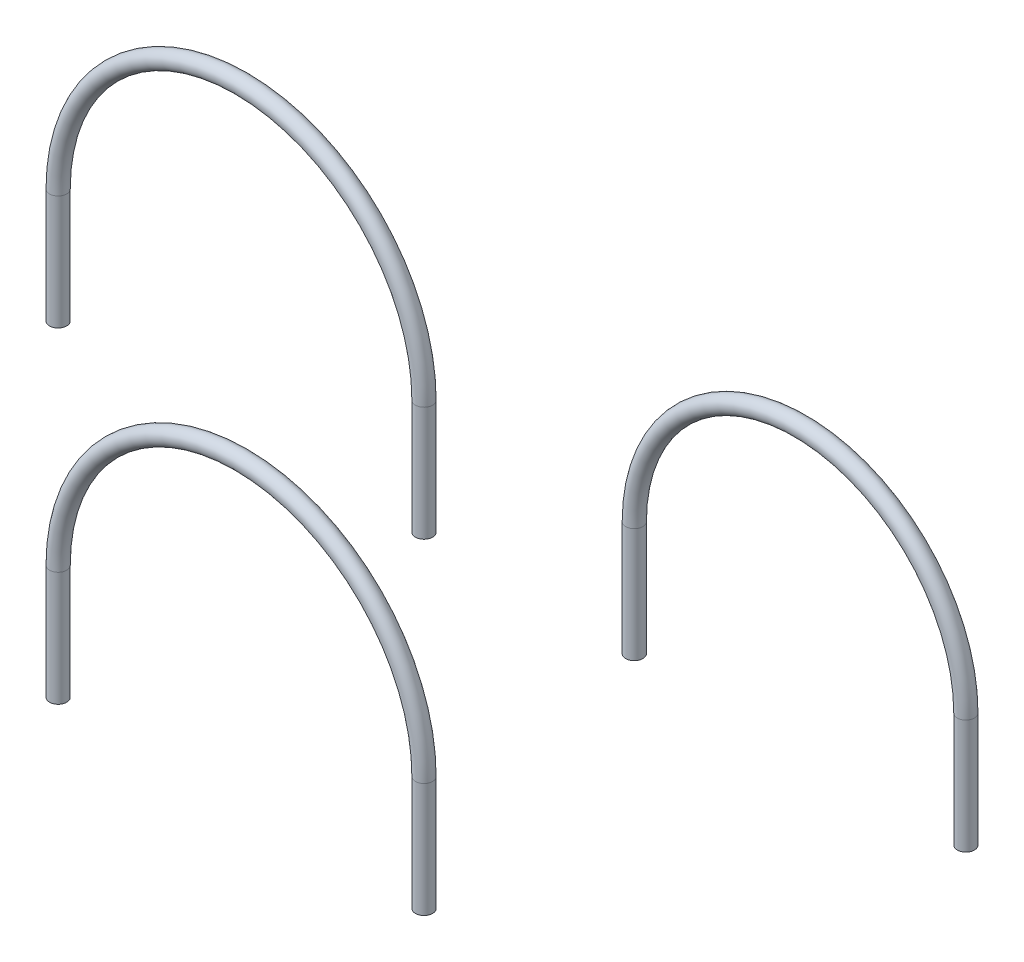
ISO-10303-21;
HEADER;
FILE_DESCRIPTION(('STEP AP214'),'2;1');
FILE_NAME('part.step','',(''),(''),'','','');
FILE_SCHEMA(('AUTOMOTIVE_DESIGN { 1 0 10303 214 1 1 1 1 }'));
ENDSEC;
DATA;
#1=APPLICATION_CONTEXT('core data for automotive mechanical design processes');
#2=APPLICATION_PROTOCOL_DEFINITION('international standard','automotive_design',2000,#1);
#3=PRODUCT_CONTEXT('',#1,'mechanical');
#4=PRODUCT('Part','Part','',(#3));
#5=PRODUCT_RELATED_PRODUCT_CATEGORY('part','',(#4));
#6=PRODUCT_DEFINITION_FORMATION('','',#4);
#7=PRODUCT_DEFINITION_CONTEXT('part definition',#1,'design');
#8=PRODUCT_DEFINITION('design','',#6,#7);
#9=PRODUCT_DEFINITION_SHAPE('','',#8);
#10=(LENGTH_UNIT() NAMED_UNIT(*) SI_UNIT(.MILLI.,.METRE.));
#11=(NAMED_UNIT(*) PLANE_ANGLE_UNIT() SI_UNIT($,.RADIAN.));
#12=(NAMED_UNIT(*) SI_UNIT($,.STERADIAN.) SOLID_ANGLE_UNIT());
#13=UNCERTAINTY_MEASURE_WITH_UNIT(LENGTH_MEASURE(1.E-05),#10,'distance_accuracy_value','');
#14=(GEOMETRIC_REPRESENTATION_CONTEXT(3) GLOBAL_UNCERTAINTY_ASSIGNED_CONTEXT((#13)) GLOBAL_UNIT_ASSIGNED_CONTEXT((#10,
#11,#12)) REPRESENTATION_CONTEXT('',''));
#15=CARTESIAN_POINT('',(0.,0.,0.));
#16=DIRECTION('',(0.,0.,1.));
#17=DIRECTION('',(1.,0.,0.));
#18=AXIS2_PLACEMENT_3D('',#15,#16,#17);
#19=CARTESIAN_POINT('',(703.331586522493,-1540.,0.));
#20=DIRECTION('',(0.,1.,0.));
#21=DIRECTION('',(-1.,0.,0.));
#22=AXIS2_PLACEMENT_3D('',#19,#20,#21);
#23=PLANE('',#22);
#24=CARTESIAN_POINT('',(703.331586522493,-1540.,0.));
#25=DIRECTION('',(0.,1.,0.));
#26=DIRECTION('',(-1.,0.,0.));
#27=AXIS2_PLACEMENT_3D('',#24,#25,#26);
#28=CIRCLE('',#27,27.);
#29=CARTESIAN_POINT('',(676.331586522493,-1540.,0.));
#30=VERTEX_POINT('',#29);
#31=EDGE_CURVE('E97',#30,#30,#28,.T.);
#32=ORIENTED_EDGE('',*,*,#31,.T.);
#33=EDGE_LOOP('',(#32));
#34=FACE_BOUND('',#33,.T.);
#35=CARTESIAN_POINT('',(703.331586522493,-1540.,0.));
#36=DIRECTION('',(0.,1.,0.));
#37=DIRECTION('',(-1.,0.,0.));
#38=AXIS2_PLACEMENT_3D('',#35,#36,#37);
#39=CIRCLE('',#38,30.);
#40=CARTESIAN_POINT('',(673.331586522493,-1540.,0.));
#41=VERTEX_POINT('',#40);
#42=EDGE_CURVE('E88',#41,#41,#39,.T.);
#43=ORIENTED_EDGE('',*,*,#42,.F.);
#44=EDGE_LOOP('',(#43));
#45=FACE_BOUND('',#44,.T.);
#46=ADVANCED_FACE('F74',(#34,#45),#23,.F.);
#47=CARTESIAN_POINT('',(-576.668413477507,-1540.,0.));
#48=DIRECTION('',(0.,-1.,0.));
#49=DIRECTION('',(1.,0.,0.));
#50=AXIS2_PLACEMENT_3D('',#47,#48,#49);
#51=PLANE('',#50);
#52=CARTESIAN_POINT('',(-576.668413477507,-1540.,0.));
#53=DIRECTION('',(0.,-1.,0.));
#54=DIRECTION('',(1.,0.,0.));
#55=AXIS2_PLACEMENT_3D('',#52,#53,#54);
#56=CIRCLE('',#55,27.);
#57=CARTESIAN_POINT('',(-549.668413477507,-1540.,0.));
#58=VERTEX_POINT('',#57);
#59=EDGE_CURVE('E93',#58,#58,#56,.T.);
#60=ORIENTED_EDGE('',*,*,#59,.F.);
#61=EDGE_LOOP('',(#60));
#62=FACE_BOUND('',#61,.T.);
#63=CARTESIAN_POINT('',(-576.668413477507,-1540.,0.));
#64=DIRECTION('',(0.,-1.,0.));
#65=DIRECTION('',(1.,0.,0.));
#66=AXIS2_PLACEMENT_3D('',#63,#64,#65);
#67=CIRCLE('',#66,30.);
#68=CARTESIAN_POINT('',(-546.668413477507,-1540.,0.));
#69=VERTEX_POINT('',#68);
#70=EDGE_CURVE('E12',#69,#69,#67,.T.);
#71=ORIENTED_EDGE('',*,*,#70,.T.);
#72=EDGE_LOOP('',(#71));
#73=FACE_BOUND('',#72,.T.);
#74=ADVANCED_FACE('F133',(#62,#73),#51,.T.);
#75=CARTESIAN_POINT('',(703.331586522493,-1540.,0.));
#76=DIRECTION('',(0.,1.,0.));
#77=DIRECTION('',(0.,0.,1.));
#78=AXIS2_PLACEMENT_3D('',#75,#76,#77);
#79=CYLINDRICAL_SURFACE('',#78,30.);
#80=CARTESIAN_POINT('',(703.331586522493,-1140.,0.));
#81=DIRECTION('',(0.,1.,0.));
#82=DIRECTION('',(-1.,0.,0.));
#83=AXIS2_PLACEMENT_3D('',#80,#81,#82);
#84=CIRCLE('',#83,30.);
#85=CARTESIAN_POINT('',(733.331586522493,-1140.,0.));
#86=VERTEX_POINT('',#85);
#87=EDGE_CURVE('E84',#86,#86,#84,.T.);
#88=ORIENTED_EDGE('',*,*,#87,.F.);
#89=EDGE_LOOP('',(#88));
#90=FACE_BOUND('',#89,.T.);
#91=ORIENTED_EDGE('',*,*,#42,.T.);
#92=EDGE_LOOP('',(#91));
#93=FACE_BOUND('',#92,.T.);
#94=ADVANCED_FACE('F129',(#90,#93),#79,.T.);
#95=CARTESIAN_POINT('',(63.331586522493,-1140.,0.));
#96=DIRECTION('',(0.,0.,1.));
#97=DIRECTION('',(1.,0.,0.));
#98=AXIS2_PLACEMENT_3D('',#95,#96,#97);
#99=TOROIDAL_SURFACE('',#98,640.,30.);
#100=CARTESIAN_POINT('',(-576.668413477507,-1140.,0.));
#101=DIRECTION('',(0.,-1.,0.));
#102=DIRECTION('',(1.,0.,0.));
#103=AXIS2_PLACEMENT_3D('',#100,#101,#102);
#104=CIRCLE('',#103,30.);
#105=CARTESIAN_POINT('',(-606.668413477507,-1140.,0.));
#106=VERTEX_POINT('',#105);
#107=EDGE_CURVE('E80',#106,#106,#104,.T.);
#108=CARTESIAN_POINT('',(63.331586522493,-1140.,0.));
#109=DIRECTION('',(0.,0.,1.));
#110=DIRECTION('',(1.,0.,0.));
#111=AXIS2_PLACEMENT_3D('',#108,#109,#110);
#112=CIRCLE('',#111,670.);
#113=EDGE_CURVE('',#86,#106,#112,.T.);
#114=ORIENTED_EDGE('',*,*,#87,.T.);
#115=ORIENTED_EDGE('',*,*,#107,.F.);
#116=ORIENTED_EDGE('',*,*,#113,.T.);
#117=ORIENTED_EDGE('',*,*,#113,.F.);
#118=EDGE_LOOP('',(#114,#116,#115,#117));
#119=FACE_BOUND('',#118,.T.);
#120=ADVANCED_FACE('F123',(#119),#99,.T.);
#121=CARTESIAN_POINT('',(-576.668413477507,-1140.,0.));
#122=DIRECTION('',(0.,-1.,0.));
#123=DIRECTION('',(1.,0.,0.));
#124=AXIS2_PLACEMENT_3D('',#121,#122,#123);
#125=CYLINDRICAL_SURFACE('',#124,30.);
#126=ORIENTED_EDGE('',*,*,#70,.F.);
#127=EDGE_LOOP('',(#126));
#128=FACE_BOUND('',#127,.T.);
#129=ORIENTED_EDGE('',*,*,#107,.T.);
#130=EDGE_LOOP('',(#129));
#131=FACE_BOUND('',#130,.T.);
#132=ADVANCED_FACE('F120',(#128,#131),#125,.T.);
#133=CARTESIAN_POINT('',(703.331586522493,-1540.,0.));
#134=DIRECTION('',(0.,1.,0.));
#135=DIRECTION('',(0.,0.,1.));
#136=AXIS2_PLACEMENT_3D('',#133,#134,#135);
#137=CYLINDRICAL_SURFACE('',#136,27.);
#138=CARTESIAN_POINT('',(703.331586522493,-1140.,0.));
#139=DIRECTION('',(0.,-1.,0.));
#140=DIRECTION('',(1.,0.,0.));
#141=AXIS2_PLACEMENT_3D('',#138,#139,#140);
#142=CIRCLE('',#141,27.);
#143=CARTESIAN_POINT('',(730.331586522493,-1140.,0.));
#144=VERTEX_POINT('',#143);
#145=EDGE_CURVE('E100',#144,#144,#142,.F.);
#146=ORIENTED_EDGE('',*,*,#145,.T.);
#147=EDGE_LOOP('',(#146));
#148=FACE_BOUND('',#147,.T.);
#149=ORIENTED_EDGE('',*,*,#31,.F.);
#150=EDGE_LOOP('',(#149));
#151=FACE_BOUND('',#150,.T.);
#152=ADVANCED_FACE('F106',(#148,#151),#137,.F.);
#153=CARTESIAN_POINT('',(63.331586522493,-1140.,0.));
#154=DIRECTION('',(0.,0.,1.));
#155=DIRECTION('',(1.,0.,0.));
#156=AXIS2_PLACEMENT_3D('',#153,#154,#155);
#157=TOROIDAL_SURFACE('',#156,640.,27.);
#158=CARTESIAN_POINT('',(-576.668413477507,-1140.,0.));
#159=DIRECTION('',(0.,-1.,0.));
#160=DIRECTION('',(1.,0.,0.));
#161=AXIS2_PLACEMENT_3D('',#158,#159,#160);
#162=CIRCLE('',#161,27.);
#163=CARTESIAN_POINT('',(-603.668413477507,-1140.,0.));
#164=VERTEX_POINT('',#163);
#165=EDGE_CURVE('E96',#164,#164,#162,.T.);
#166=CARTESIAN_POINT('',(63.331586522493,-1140.,0.));
#167=DIRECTION('',(0.,0.,1.));
#168=DIRECTION('',(1.,0.,0.));
#169=AXIS2_PLACEMENT_3D('',#166,#167,#168);
#170=CIRCLE('',#169,667.);
#171=EDGE_CURVE('',#144,#164,#170,.T.);
#172=ORIENTED_EDGE('',*,*,#145,.F.);
#173=ORIENTED_EDGE('',*,*,#165,.T.);
#174=ORIENTED_EDGE('',*,*,#171,.T.);
#175=ORIENTED_EDGE('',*,*,#171,.F.);
#176=EDGE_LOOP('',(#172,#174,#173,#175));
#177=FACE_BOUND('',#176,.T.);
#178=ADVANCED_FACE('F109',(#177),#157,.F.);
#179=CARTESIAN_POINT('',(-576.668413477507,-1140.,0.));
#180=DIRECTION('',(0.,-1.,0.));
#181=DIRECTION('',(1.,0.,0.));
#182=AXIS2_PLACEMENT_3D('',#179,#180,#181);
#183=CYLINDRICAL_SURFACE('',#182,27.);
#184=ORIENTED_EDGE('',*,*,#59,.T.);
#185=EDGE_LOOP('',(#184));
#186=FACE_BOUND('',#185,.T.);
#187=ORIENTED_EDGE('',*,*,#165,.F.);
#188=EDGE_LOOP('',(#187));
#189=FACE_BOUND('',#188,.T.);
#190=ADVANCED_FACE('F111',(#186,#189),#183,.F.);
#191=CLOSED_SHELL('',(#46,#74,#94,#120,#132,#152,#178,#190));
#192=MANIFOLD_SOLID_BREP('B2',#191);
#193=CARTESIAN_POINT('',(1438.96696117461,-400.,0.));
#194=DIRECTION('',(0.,-1.,0.));
#195=DIRECTION('',(0.,0.,1.));
#196=AXIS2_PLACEMENT_3D('',#193,#194,#195);
#197=PLANE('',#196);
#198=CARTESIAN_POINT('',(1438.96696117461,-400.,0.));
#199=DIRECTION('',(0.,-1.,0.));
#200=DIRECTION('',(0.,0.,-1.));
#201=AXIS2_PLACEMENT_3D('',#198,#199,#200);
#202=CIRCLE('',#201,26.9999999999998);
#203=CARTESIAN_POINT('',(1438.96696117461,-400.,-26.9999999999998));
#204=VERTEX_POINT('',#203);
#205=EDGE_CURVE('E242',#204,#204,#202,.T.);
#206=ORIENTED_EDGE('',*,*,#205,.F.);
#207=EDGE_LOOP('',(#206));
#208=FACE_BOUND('',#207,.T.);
#209=CARTESIAN_POINT('',(1438.96696117461,-400.,0.));
#210=DIRECTION('',(0.,-1.,0.));
#211=DIRECTION('',(0.,0.,1.));
#212=AXIS2_PLACEMENT_3D('',#209,#210,#211);
#213=CIRCLE('',#212,29.9999999999998);
#214=CARTESIAN_POINT('',(1438.96696117461,-400.,29.9999999999998));
#215=VERTEX_POINT('',#214);
#216=EDGE_CURVE('E233',#215,#215,#213,.T.);
#217=ORIENTED_EDGE('',*,*,#216,.T.);
#218=EDGE_LOOP('',(#217));
#219=FACE_BOUND('',#218,.T.);
#220=ADVANCED_FACE('F219',(#208,#219),#197,.T.);
#221=CARTESIAN_POINT('',(2598.96696117461,-400.,0.));
#222=DIRECTION('',(0.,1.,0.));
#223=DIRECTION('',(0.,0.,1.));
#224=AXIS2_PLACEMENT_3D('',#221,#222,#223);
#225=PLANE('',#224);
#226=CARTESIAN_POINT('',(2598.96696117461,-400.,0.));
#227=DIRECTION('',(0.,1.,0.));
#228=DIRECTION('',(0.,0.,1.));
#229=AXIS2_PLACEMENT_3D('',#226,#227,#228);
#230=CIRCLE('',#229,26.9999999999998);
#231=CARTESIAN_POINT('',(2598.96696117461,-400.,26.9999999999998));
#232=VERTEX_POINT('',#231);
#233=EDGE_CURVE('E238',#232,#232,#230,.T.);
#234=ORIENTED_EDGE('',*,*,#233,.T.);
#235=EDGE_LOOP('',(#234));
#236=FACE_BOUND('',#235,.T.);
#237=CARTESIAN_POINT('',(2598.96696117461,-400.,0.));
#238=DIRECTION('',(0.,1.,0.));
#239=DIRECTION('',(0.,0.,1.));
#240=AXIS2_PLACEMENT_3D('',#237,#238,#239);
#241=CIRCLE('',#240,29.9999999999998);
#242=CARTESIAN_POINT('',(2598.96696117461,-400.,29.9999999999998));
#243=VERTEX_POINT('',#242);
#244=EDGE_CURVE('E73',#243,#243,#241,.T.);
#245=ORIENTED_EDGE('',*,*,#244,.F.);
#246=EDGE_LOOP('',(#245));
#247=FACE_BOUND('',#246,.T.);
#248=ADVANCED_FACE('F262',(#236,#247),#225,.F.);
#249=CARTESIAN_POINT('',(1438.96696117461,-400.,0.));
#250=DIRECTION('',(0.,1.,0.));
#251=DIRECTION('',(0.,0.,1.));
#252=AXIS2_PLACEMENT_3D('',#249,#250,#251);
#253=CYLINDRICAL_SURFACE('',#252,29.9999999999998);
#254=CARTESIAN_POINT('',(1438.96696117461,0.,0.));
#255=DIRECTION('',(0.,-1.,0.));
#256=DIRECTION('',(0.,0.,1.));
#257=AXIS2_PLACEMENT_3D('',#254,#255,#256);
#258=CIRCLE('',#257,29.9999999999998);
#259=CARTESIAN_POINT('',(1408.96696117461,0.,0.));
#260=VERTEX_POINT('',#259);
#261=EDGE_CURVE('E229',#260,#260,#258,.T.);
#262=ORIENTED_EDGE('',*,*,#261,.T.);
#263=EDGE_LOOP('',(#262));
#264=FACE_BOUND('',#263,.T.);
#265=ORIENTED_EDGE('',*,*,#216,.F.);
#266=EDGE_LOOP('',(#265));
#267=FACE_BOUND('',#266,.T.);
#268=ADVANCED_FACE('F266',(#264,#267),#253,.T.);
#269=CARTESIAN_POINT('',(2018.96696117461,0.,0.));
#270=DIRECTION('',(0.,0.,-1.));
#271=DIRECTION('',(-1.,0.,0.));
#272=AXIS2_PLACEMENT_3D('',#269,#270,#271);
#273=TOROIDAL_SURFACE('',#272,580.,29.9999999999998);
#274=CARTESIAN_POINT('',(2598.96696117461,-3.33066907387547E-13,0.));
#275=DIRECTION('',(0.,1.,0.));
#276=DIRECTION('',(0.,0.,1.));
#277=AXIS2_PLACEMENT_3D('',#274,#275,#276);
#278=CIRCLE('',#277,29.9999999999998);
#279=CARTESIAN_POINT('',(2628.96696117461,-3.45755514102538E-13,0.));
#280=VERTEX_POINT('',#279);
#281=EDGE_CURVE('E225',#280,#280,#278,.T.);
#282=CARTESIAN_POINT('',(2018.96696117461,0.,0.));
#283=DIRECTION('',(0.,0.,-1.));
#284=DIRECTION('',(-1.,0.,0.));
#285=AXIS2_PLACEMENT_3D('',#282,#283,#284);
#286=CIRCLE('',#285,610.);
#287=EDGE_CURVE('',#260,#280,#286,.T.);
#288=ORIENTED_EDGE('',*,*,#261,.F.);
#289=ORIENTED_EDGE('',*,*,#281,.T.);
#290=ORIENTED_EDGE('',*,*,#287,.T.);
#291=ORIENTED_EDGE('',*,*,#287,.F.);
#292=EDGE_LOOP('',(#288,#290,#289,#291));
#293=FACE_BOUND('',#292,.T.);
#294=ADVANCED_FACE('F268',(#293),#273,.T.);
#295=CARTESIAN_POINT('',(2598.96696117461,0.,0.));
#296=DIRECTION('',(0.,-1.,0.));
#297=DIRECTION('',(0.,0.,-1.));
#298=AXIS2_PLACEMENT_3D('',#295,#296,#297);
#299=CYLINDRICAL_SURFACE('',#298,29.9999999999998);
#300=ORIENTED_EDGE('',*,*,#244,.T.);
#301=EDGE_LOOP('',(#300));
#302=FACE_BOUND('',#301,.T.);
#303=ORIENTED_EDGE('',*,*,#281,.F.);
#304=EDGE_LOOP('',(#303));
#305=FACE_BOUND('',#304,.T.);
#306=ADVANCED_FACE('F256',(#302,#305),#299,.T.);
#307=CARTESIAN_POINT('',(1438.96696117461,-400.,0.));
#308=DIRECTION('',(0.,1.,0.));
#309=DIRECTION('',(0.,0.,1.));
#310=AXIS2_PLACEMENT_3D('',#307,#308,#309);
#311=CYLINDRICAL_SURFACE('',#310,26.9999999999998);
#312=CARTESIAN_POINT('',(1438.96696117461,0.,0.));
#313=DIRECTION('',(0.,1.,0.));
#314=DIRECTION('',(0.,0.,1.));
#315=AXIS2_PLACEMENT_3D('',#312,#313,#314);
#316=CIRCLE('',#315,26.9999999999998);
#317=CARTESIAN_POINT('',(1411.96696117461,0.,0.));
#318=VERTEX_POINT('',#317);
#319=EDGE_CURVE('E245',#318,#318,#316,.F.);
#320=ORIENTED_EDGE('',*,*,#319,.F.);
#321=EDGE_LOOP('',(#320));
#322=FACE_BOUND('',#321,.T.);
#323=ORIENTED_EDGE('',*,*,#205,.T.);
#324=EDGE_LOOP('',(#323));
#325=FACE_BOUND('',#324,.T.);
#326=ADVANCED_FACE('F253',(#322,#325),#311,.F.);
#327=CARTESIAN_POINT('',(2018.96696117461,0.,0.));
#328=DIRECTION('',(0.,0.,-1.));
#329=DIRECTION('',(-1.,0.,0.));
#330=AXIS2_PLACEMENT_3D('',#327,#328,#329);
#331=TOROIDAL_SURFACE('',#330,580.,26.9999999999998);
#332=CARTESIAN_POINT('',(2598.96696117461,-2.74296071593532E-13,0.));
#333=DIRECTION('',(0.,1.,0.));
#334=DIRECTION('',(-1.,0.,0.));
#335=AXIS2_PLACEMENT_3D('',#332,#333,#334);
#336=CIRCLE('',#335,26.9999999999998);
#337=CARTESIAN_POINT('',(2625.96696117461,-2.82979933901786E-13,0.));
#338=VERTEX_POINT('',#337);
#339=EDGE_CURVE('E241',#338,#338,#336,.T.);
#340=CARTESIAN_POINT('',(2018.96696117461,0.,0.));
#341=DIRECTION('',(0.,0.,-1.));
#342=DIRECTION('',(-1.,0.,0.));
#343=AXIS2_PLACEMENT_3D('',#340,#341,#342);
#344=CIRCLE('',#343,607.);
#345=EDGE_CURVE('',#318,#338,#344,.T.);
#346=ORIENTED_EDGE('',*,*,#319,.T.);
#347=ORIENTED_EDGE('',*,*,#339,.F.);
#348=ORIENTED_EDGE('',*,*,#345,.T.);
#349=ORIENTED_EDGE('',*,*,#345,.F.);
#350=EDGE_LOOP('',(#346,#348,#347,#349));
#351=FACE_BOUND('',#350,.T.);
#352=ADVANCED_FACE('F251',(#351),#331,.F.);
#353=CARTESIAN_POINT('',(2598.96696117461,0.,0.));
#354=DIRECTION('',(0.,-1.,0.));
#355=DIRECTION('',(0.,0.,-1.));
#356=AXIS2_PLACEMENT_3D('',#353,#354,#355);
#357=CYLINDRICAL_SURFACE('',#356,26.9999999999998);
#358=ORIENTED_EDGE('',*,*,#233,.F.);
#359=EDGE_LOOP('',(#358));
#360=FACE_BOUND('',#359,.T.);
#361=ORIENTED_EDGE('',*,*,#339,.T.);
#362=EDGE_LOOP('',(#361));
#363=FACE_BOUND('',#362,.T.);
#364=ADVANCED_FACE('F263',(#360,#363),#357,.F.);
#365=CLOSED_SHELL('',(#220,#248,#268,#294,#306,#326,#352,#364));
#366=MANIFOLD_SOLID_BREP('B7',#365);
#367=CARTESIAN_POINT('',(703.331586522493,-400.,0.));
#368=DIRECTION('',(0.,1.,0.));
#369=DIRECTION('',(-1.,0.,0.));
#370=AXIS2_PLACEMENT_3D('',#367,#368,#369);
#371=PLANE('',#370);
#372=CARTESIAN_POINT('',(703.331586522493,-400.,0.));
#373=DIRECTION('',(0.,1.,0.));
#374=DIRECTION('',(-1.,0.,0.));
#375=AXIS2_PLACEMENT_3D('',#372,#373,#374);
#376=CIRCLE('',#375,27.);
#377=CARTESIAN_POINT('',(676.331586522493,-400.,0.));
#378=VERTEX_POINT('',#377);
#379=EDGE_CURVE('E385',#378,#378,#376,.T.);
#380=ORIENTED_EDGE('',*,*,#379,.T.);
#381=EDGE_LOOP('',(#380));
#382=FACE_BOUND('',#381,.T.);
#383=CARTESIAN_POINT('',(703.331586522493,-400.,0.));
#384=DIRECTION('',(0.,1.,0.));
#385=DIRECTION('',(-1.,0.,0.));
#386=AXIS2_PLACEMENT_3D('',#383,#384,#385);
#387=CIRCLE('',#386,30.);
#388=CARTESIAN_POINT('',(673.331586522493,-400.,0.));
#389=VERTEX_POINT('',#388);
#390=EDGE_CURVE('E374',#389,#389,#387,.T.);
#391=ORIENTED_EDGE('',*,*,#390,.F.);
#392=EDGE_LOOP('',(#391));
#393=FACE_BOUND('',#392,.T.);
#394=ADVANCED_FACE('F357',(#382,#393),#371,.F.);
#395=CARTESIAN_POINT('',(-576.668413477507,-400.,0.));
#396=DIRECTION('',(0.,-1.,0.));
#397=DIRECTION('',(1.,0.,0.));
#398=AXIS2_PLACEMENT_3D('',#395,#396,#397);
#399=PLANE('',#398);
#400=CARTESIAN_POINT('',(-576.668413477507,-400.,0.));
#401=DIRECTION('',(0.,-1.,0.));
#402=DIRECTION('',(1.,0.,0.));
#403=AXIS2_PLACEMENT_3D('',#400,#401,#402);
#404=CIRCLE('',#403,27.);
#405=CARTESIAN_POINT('',(-549.668413477507,-400.,0.));
#406=VERTEX_POINT('',#405);
#407=EDGE_CURVE('E380',#406,#406,#404,.T.);
#408=ORIENTED_EDGE('',*,*,#407,.F.);
#409=EDGE_LOOP('',(#408));
#410=FACE_BOUND('',#409,.T.);
#411=CARTESIAN_POINT('',(-576.668413477507,-400.,0.));
#412=DIRECTION('',(0.,-1.,0.));
#413=DIRECTION('',(1.,0.,0.));
#414=AXIS2_PLACEMENT_3D('',#411,#412,#413);
#415=CIRCLE('',#414,30.);
#416=CARTESIAN_POINT('',(-546.668413477507,-400.,0.));
#417=VERTEX_POINT('',#416);
#418=EDGE_CURVE('E218',#417,#417,#415,.T.);
#419=ORIENTED_EDGE('',*,*,#418,.T.);
#420=EDGE_LOOP('',(#419));
#421=FACE_BOUND('',#420,.T.);
#422=ADVANCED_FACE('F424',(#410,#421),#399,.T.);
#423=CARTESIAN_POINT('',(703.331586522493,-400.,0.));
#424=DIRECTION('',(0.,1.,0.));
#425=DIRECTION('',(0.,0.,1.));
#426=AXIS2_PLACEMENT_3D('',#423,#424,#425);
#427=CYLINDRICAL_SURFACE('',#426,30.);
#428=CARTESIAN_POINT('',(703.331586522493,0.,0.));
#429=DIRECTION('',(0.,1.,0.));
#430=DIRECTION('',(-1.,0.,0.));
#431=AXIS2_PLACEMENT_3D('',#428,#429,#430);
#432=CIRCLE('',#431,30.);
#433=CARTESIAN_POINT('',(733.331586522493,0.,0.));
#434=VERTEX_POINT('',#433);
#435=EDGE_CURVE('E369',#434,#434,#432,.T.);
#436=ORIENTED_EDGE('',*,*,#435,.F.);
#437=EDGE_LOOP('',(#436));
#438=FACE_BOUND('',#437,.T.);
#439=ORIENTED_EDGE('',*,*,#390,.T.);
#440=EDGE_LOOP('',(#439));
#441=FACE_BOUND('',#440,.T.);
#442=ADVANCED_FACE('F420',(#438,#441),#427,.T.);
#443=CARTESIAN_POINT('',(63.331586522493,-1.28374582382482E-13,0.));
#444=DIRECTION('',(0.,0.,1.));
#445=DIRECTION('',(1.,0.,0.));
#446=AXIS2_PLACEMENT_3D('',#443,#444,#445);
#447=TOROIDAL_SURFACE('',#446,640.,30.);
#448=CARTESIAN_POINT('',(-576.668413477507,-1.11022302462516E-13,0.));
#449=DIRECTION('',(0.,-1.,0.));
#450=DIRECTION('',(1.,0.,0.));
#451=AXIS2_PLACEMENT_3D('',#448,#449,#450);
#452=CIRCLE('',#451,30.);
#453=CARTESIAN_POINT('',(-606.668413477507,-1.10208914341267E-13,0.));
#454=VERTEX_POINT('',#453);
#455=EDGE_CURVE('E364',#454,#454,#452,.T.);
#456=CARTESIAN_POINT('',(63.331586522493,-1.28374582382482E-13,0.));
#457=DIRECTION('',(0.,0.,1.));
#458=DIRECTION('',(1.,0.,0.));
#459=AXIS2_PLACEMENT_3D('',#456,#457,#458);
#460=CIRCLE('',#459,670.);
#461=EDGE_CURVE('',#434,#454,#460,.T.);
#462=ORIENTED_EDGE('',*,*,#435,.T.);
#463=ORIENTED_EDGE('',*,*,#455,.F.);
#464=ORIENTED_EDGE('',*,*,#461,.T.);
#465=ORIENTED_EDGE('',*,*,#461,.F.);
#466=EDGE_LOOP('',(#462,#464,#463,#465));
#467=FACE_BOUND('',#466,.T.);
#468=ADVANCED_FACE('F414',(#467),#447,.T.);
#469=CARTESIAN_POINT('',(-576.668413477507,0.,0.));
#470=DIRECTION('',(0.,-1.,0.));
#471=DIRECTION('',(1.,0.,0.));
#472=AXIS2_PLACEMENT_3D('',#469,#470,#471);
#473=CYLINDRICAL_SURFACE('',#472,30.);
#474=ORIENTED_EDGE('',*,*,#418,.F.);
#475=EDGE_LOOP('',(#474));
#476=FACE_BOUND('',#475,.T.);
#477=ORIENTED_EDGE('',*,*,#455,.T.);
#478=EDGE_LOOP('',(#477));
#479=FACE_BOUND('',#478,.T.);
#480=ADVANCED_FACE('F411',(#476,#479),#473,.T.);
#481=CARTESIAN_POINT('',(703.331586522493,-400.,0.));
#482=DIRECTION('',(0.,1.,0.));
#483=DIRECTION('',(0.,0.,1.));
#484=AXIS2_PLACEMENT_3D('',#481,#482,#483);
#485=CYLINDRICAL_SURFACE('',#484,27.);
#486=CARTESIAN_POINT('',(703.331586522493,0.,0.));
#487=DIRECTION('',(0.,-1.,0.));
#488=DIRECTION('',(1.,0.,0.));
#489=AXIS2_PLACEMENT_3D('',#486,#487,#488);
#490=CIRCLE('',#489,27.);
#491=CARTESIAN_POINT('',(730.331586522493,0.,0.));
#492=VERTEX_POINT('',#491);
#493=EDGE_CURVE('E389',#492,#492,#490,.F.);
#494=ORIENTED_EDGE('',*,*,#493,.T.);
#495=EDGE_LOOP('',(#494));
#496=FACE_BOUND('',#495,.T.);
#497=ORIENTED_EDGE('',*,*,#379,.F.);
#498=EDGE_LOOP('',(#497));
#499=FACE_BOUND('',#498,.T.);
#500=ADVANCED_FACE('F397',(#496,#499),#485,.F.);
#501=CARTESIAN_POINT('',(63.331586522493,-1.28374582382482E-13,0.));
#502=DIRECTION('',(0.,0.,1.));
#503=DIRECTION('',(1.,0.,0.));
#504=AXIS2_PLACEMENT_3D('',#501,#502,#503);
#505=TOROIDAL_SURFACE('',#504,640.,27.);
#506=CARTESIAN_POINT('',(-576.668413477507,0.,0.));
#507=DIRECTION('',(0.,-1.,0.));
#508=DIRECTION('',(1.,0.,0.));
#509=AXIS2_PLACEMENT_3D('',#506,#507,#508);
#510=CIRCLE('',#509,27.);
#511=CARTESIAN_POINT('',(-603.668413477507,0.,0.));
#512=VERTEX_POINT('',#511);
#513=EDGE_CURVE('E384',#512,#512,#510,.T.);
#514=CARTESIAN_POINT('',(63.331586522493,-1.28374582382482E-13,0.));
#515=DIRECTION('',(0.,0.,1.));
#516=DIRECTION('',(1.,0.,0.));
#517=AXIS2_PLACEMENT_3D('',#514,#515,#516);
#518=CIRCLE('',#517,667.);
#519=EDGE_CURVE('',#492,#512,#518,.T.);
#520=ORIENTED_EDGE('',*,*,#493,.F.);
#521=ORIENTED_EDGE('',*,*,#513,.T.);
#522=ORIENTED_EDGE('',*,*,#519,.T.);
#523=ORIENTED_EDGE('',*,*,#519,.F.);
#524=EDGE_LOOP('',(#520,#522,#521,#523));
#525=FACE_BOUND('',#524,.T.);
#526=ADVANCED_FACE('F400',(#525),#505,.F.);
#527=CARTESIAN_POINT('',(-576.668413477507,0.,0.));
#528=DIRECTION('',(0.,-1.,0.));
#529=DIRECTION('',(1.,0.,0.));
#530=AXIS2_PLACEMENT_3D('',#527,#528,#529);
#531=CYLINDRICAL_SURFACE('',#530,27.);
#532=ORIENTED_EDGE('',*,*,#407,.T.);
#533=EDGE_LOOP('',(#532));
#534=FACE_BOUND('',#533,.T.);
#535=ORIENTED_EDGE('',*,*,#513,.F.);
#536=EDGE_LOOP('',(#535));
#537=FACE_BOUND('',#536,.T.);
#538=ADVANCED_FACE('F402',(#534,#537),#531,.F.);
#539=CLOSED_SHELL('',(#394,#422,#442,#468,#480,#500,#526,#538));
#540=MANIFOLD_SOLID_BREP('B68',#539);
#541=ADVANCED_BREP_SHAPE_REPRESENTATION('',(#18,#192,#366,#540),#14);
#542=SHAPE_DEFINITION_REPRESENTATION(#9,#541);
ENDSEC;
END-ISO-10303-21;
